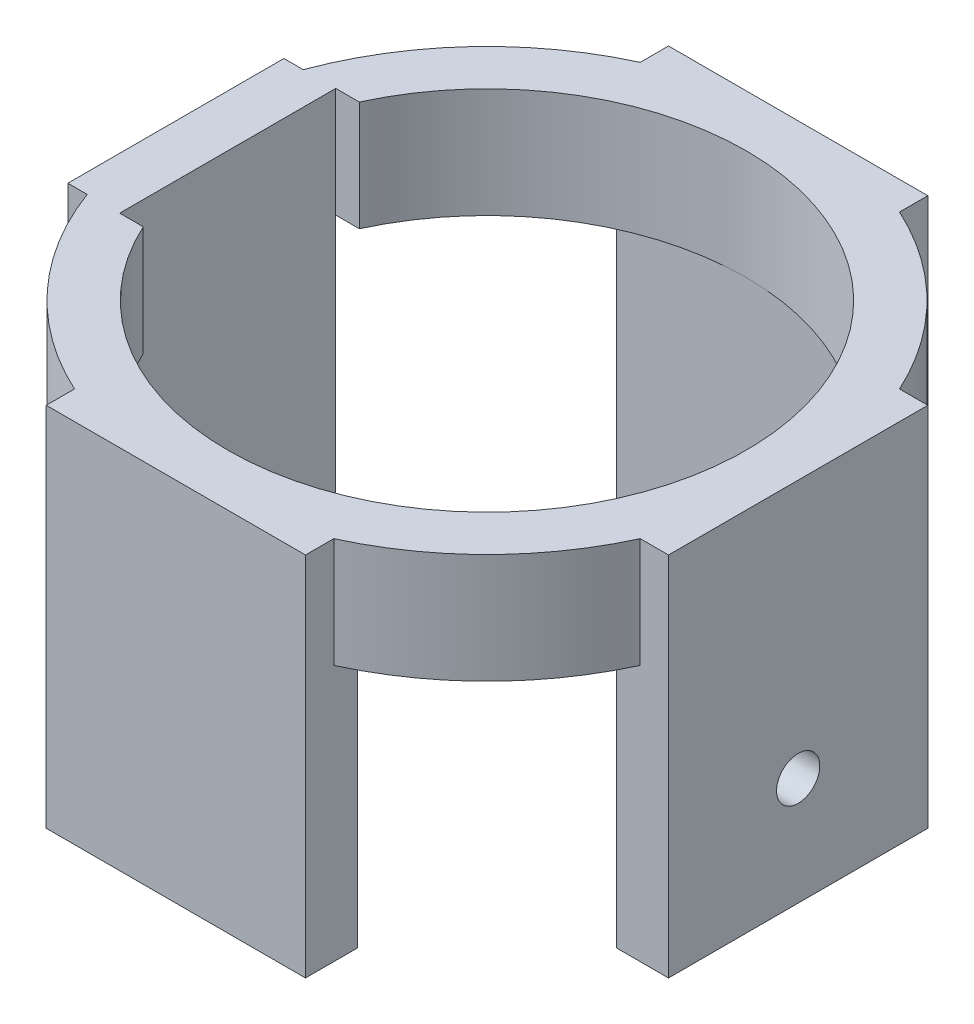
ISO-10303-21;
HEADER;
FILE_DESCRIPTION(('STEP AP214'),'2;1');
FILE_NAME('part.step','',(''),(''),'','','');
FILE_SCHEMA(('AUTOMOTIVE_DESIGN { 1 0 10303 214 1 1 1 1 }'));
ENDSEC;
DATA;
#1=APPLICATION_CONTEXT('core data for automotive mechanical design processes');
#2=APPLICATION_PROTOCOL_DEFINITION('international standard','automotive_design',2000,#1);
#3=PRODUCT_CONTEXT('',#1,'mechanical');
#4=PRODUCT('Part','Part','',(#3));
#5=PRODUCT_RELATED_PRODUCT_CATEGORY('part','',(#4));
#6=PRODUCT_DEFINITION_FORMATION('','',#4);
#7=PRODUCT_DEFINITION_CONTEXT('part definition',#1,'design');
#8=PRODUCT_DEFINITION('design','',#6,#7);
#9=PRODUCT_DEFINITION_SHAPE('','',#8);
#10=(LENGTH_UNIT() NAMED_UNIT(*) SI_UNIT(.MILLI.,.METRE.));
#11=(NAMED_UNIT(*) PLANE_ANGLE_UNIT() SI_UNIT($,.RADIAN.));
#12=(NAMED_UNIT(*) SI_UNIT($,.STERADIAN.) SOLID_ANGLE_UNIT());
#13=UNCERTAINTY_MEASURE_WITH_UNIT(LENGTH_MEASURE(1.E-05),#10,'distance_accuracy_value','');
#14=(GEOMETRIC_REPRESENTATION_CONTEXT(3) GLOBAL_UNCERTAINTY_ASSIGNED_CONTEXT((#13)) GLOBAL_UNIT_ASSIGNED_CONTEXT((#10,
#11,#12)) REPRESENTATION_CONTEXT('',''));
#15=CARTESIAN_POINT('',(0.,0.,0.));
#16=DIRECTION('',(0.,0.,1.));
#17=DIRECTION('',(1.,0.,0.));
#18=AXIS2_PLACEMENT_3D('',#15,#16,#17);
#19=CARTESIAN_POINT('',(60.,0.,0.));
#20=DIRECTION('',(1.,0.,0.));
#21=DIRECTION('',(0.,0.,-1.));
#22=AXIS2_PLACEMENT_3D('',#19,#20,#21);
#23=PLANE('',#22);
#24=DIRECTION('',(0.,-1.,0.));
#25=VECTOR('',#24,1.);
#26=CARTESIAN_POINT('',(60.,0.,30.));
#27=LINE('',#26,#25);
#28=CARTESIAN_POINT('',(60.,-25.4,30.));
#29=VERTEX_POINT('',#28);
#30=CARTESIAN_POINT('',(60.,-84.7705,30.));
#31=VERTEX_POINT('',#30);
#32=EDGE_CURVE('E266',#29,#31,#27,.T.);
#33=ORIENTED_EDGE('',*,*,#32,.F.);
#34=DIRECTION('',(0.,0.,-1.));
#35=VECTOR('',#34,1.);
#36=CARTESIAN_POINT('',(60.,-25.4,0.));
#37=LINE('',#36,#35);
#38=CARTESIAN_POINT('',(60.,-25.4,0.));
#39=VERTEX_POINT('',#38);
#40=EDGE_CURVE('E285',#29,#39,#37,.T.);
#41=ORIENTED_EDGE('',*,*,#40,.T.);
#42=CARTESIAN_POINT('',(60.,-25.4,-30.));
#43=VERTEX_POINT('',#42);
#44=EDGE_CURVE('E281',#39,#43,#37,.T.);
#45=ORIENTED_EDGE('',*,*,#44,.T.);
#46=DIRECTION('',(0.,-1.,0.));
#47=VECTOR('',#46,1.);
#48=CARTESIAN_POINT('',(60.,0.,-30.));
#49=LINE('',#48,#47);
#50=CARTESIAN_POINT('',(60.,-84.7705,-30.));
#51=VERTEX_POINT('',#50);
#52=EDGE_CURVE('E262',#43,#51,#49,.T.);
#53=ORIENTED_EDGE('',*,*,#52,.T.);
#54=DIRECTION('',(0.,0.,1.));
#55=VECTOR('',#54,1.);
#56=CARTESIAN_POINT('',(60.,-84.7705,-30.));
#57=LINE('',#56,#55);
#58=EDGE_CURVE('E248',#51,#31,#57,.T.);
#59=ORIENTED_EDGE('',*,*,#58,.T.);
#60=EDGE_LOOP('',(#33,#41,#45,#53,#59));
#61=FACE_BOUND('',#60,.T.);
#62=CARTESIAN_POINT('',(60.,-59.7705,0.));
#63=DIRECTION('',(-1.,0.,0.));
#64=DIRECTION('',(0.,0.,1.));
#65=AXIS2_PLACEMENT_3D('',#62,#63,#64);
#66=CIRCLE('',#65,5.);
#67=CARTESIAN_POINT('',(60.,-59.7705,4.99999999999999));
#68=VERTEX_POINT('',#67);
#69=EDGE_CURVE('E568',#68,#68,#66,.T.);
#70=ORIENTED_EDGE('',*,*,#69,.F.);
#71=EDGE_LOOP('',(#70));
#72=FACE_BOUND('',#71,.T.);
#73=ADVANCED_FACE('F39',(#61,#72),#23,.F.);
#74=CARTESIAN_POINT('',(0.,-25.4,0.));
#75=DIRECTION('',(0.,1.,0.));
#76=DIRECTION('',(0.,0.,1.));
#77=AXIS2_PLACEMENT_3D('',#74,#75,#76);
#78=PLANE('',#77);
#79=CARTESIAN_POINT('',(0.,-25.4,0.));
#80=DIRECTION('',(0.,1.,0.));
#81=DIRECTION('',(0.,0.,1.));
#82=AXIS2_PLACEMENT_3D('',#79,#80,#81);
#83=CIRCLE('',#82,72.);
#84=CARTESIAN_POINT('',(29.9999999999998,-25.4,65.4522726878144));
#85=VERTEX_POINT('',#84);
#86=CARTESIAN_POINT('',(65.4522726878143,-25.4,30.));
#87=VERTEX_POINT('',#86);
#88=EDGE_CURVE('E63',#85,#87,#83,.T.);
#89=ORIENTED_EDGE('',*,*,#88,.F.);
#90=DIRECTION('',(0.,0.,-1.));
#91=VECTOR('',#90,1.);
#92=CARTESIAN_POINT('',(30.,-25.4,1.04744440165294E-13));
#93=LINE('',#92,#91);
#94=CARTESIAN_POINT('',(29.9999999999998,-25.4,60.0000000000001));
#95=VERTEX_POINT('',#94);
#96=EDGE_CURVE('E517',#85,#95,#93,.T.);
#97=ORIENTED_EDGE('',*,*,#96,.T.);
#98=DIRECTION('',(1.,0.,0.));
#99=VECTOR('',#98,1.);
#100=CARTESIAN_POINT('',(-2.09488880330588E-13,-25.4,60.));
#101=LINE('',#100,#99);
#102=CARTESIAN_POINT('',(-2.09488880330588E-13,-25.4,60.));
#103=VERTEX_POINT('',#102);
#104=EDGE_CURVE('E493',#103,#95,#101,.T.);
#105=ORIENTED_EDGE('',*,*,#104,.F.);
#106=CARTESIAN_POINT('',(0.,-25.4,0.));
#107=DIRECTION('',(0.,1.,0.));
#108=DIRECTION('',(0.,0.,1.));
#109=AXIS2_PLACEMENT_3D('',#106,#107,#108);
#110=CIRCLE('',#109,60.);
#111=EDGE_CURVE('E393',#103,#39,#110,.T.);
#112=ORIENTED_EDGE('',*,*,#111,.T.);
#113=ORIENTED_EDGE('',*,*,#40,.F.);
#114=DIRECTION('',(-1.,0.,0.));
#115=VECTOR('',#114,1.);
#116=CARTESIAN_POINT('',(0.,-25.4,30.));
#117=LINE('',#116,#115);
#118=EDGE_CURVE('E286',#87,#29,#117,.T.);
#119=ORIENTED_EDGE('',*,*,#118,.F.);
#120=EDGE_LOOP('',(#89,#97,#105,#112,#113,#119));
#121=FACE_BOUND('',#120,.T.);
#122=ADVANCED_FACE('F576',(#121),#78,.F.);
#123=CARTESIAN_POINT('',(0.,-25.4,0.));
#124=DIRECTION('',(0.,1.,0.));
#125=DIRECTION('',(0.,0.,1.));
#126=AXIS2_PLACEMENT_3D('',#123,#124,#125);
#127=CYLINDRICAL_SURFACE('',#126,72.);
#128=ORIENTED_EDGE('',*,*,#88,.T.);
#129=DIRECTION('',(0.,1.,0.));
#130=VECTOR('',#129,1.);
#131=CARTESIAN_POINT('',(65.4522726878143,-25.4,30.));
#132=LINE('',#131,#130);
#133=CARTESIAN_POINT('',(65.4522726878143,0.,30.));
#134=VERTEX_POINT('',#133);
#135=EDGE_CURVE('E290',#87,#134,#132,.T.);
#136=ORIENTED_EDGE('',*,*,#135,.T.);
#137=CARTESIAN_POINT('',(0.,0.,0.));
#138=DIRECTION('',(0.,1.,0.));
#139=DIRECTION('',(0.,0.,1.));
#140=AXIS2_PLACEMENT_3D('',#137,#138,#139);
#141=CIRCLE('',#140,72.);
#142=CARTESIAN_POINT('',(29.9999999999998,0.,65.4522726878144));
#143=VERTEX_POINT('',#142);
#144=EDGE_CURVE('E55',#143,#134,#141,.T.);
#145=ORIENTED_EDGE('',*,*,#144,.F.);
#146=DIRECTION('',(0.,1.,0.));
#147=VECTOR('',#146,1.);
#148=CARTESIAN_POINT('',(29.9999999999998,-25.4,65.4522726878144));
#149=LINE('',#148,#147);
#150=EDGE_CURVE('E48',#85,#143,#149,.T.);
#151=ORIENTED_EDGE('',*,*,#150,.F.);
#152=EDGE_LOOP('',(#128,#136,#145,#151));
#153=FACE_BOUND('',#152,.T.);
#154=ADVANCED_FACE('F581',(#153),#127,.T.);
#155=CARTESIAN_POINT('',(29.9999999999994,0.,175.85585043824));
#156=DIRECTION('',(1.,0.,0.));
#157=DIRECTION('',(0.,1.,0.));
#158=AXIS2_PLACEMENT_3D('',#155,#156,#157);
#159=PLANE('',#158);
#160=ORIENTED_EDGE('',*,*,#96,.F.);
#161=ORIENTED_EDGE('',*,*,#150,.T.);
#162=DIRECTION('',(0.,0.,-1.));
#163=VECTOR('',#162,1.);
#164=CARTESIAN_POINT('',(29.9999999999994,0.,175.85585043824));
#165=LINE('',#164,#163);
#166=CARTESIAN_POINT('',(29.9999999999998,0.,72.0000000000001));
#167=VERTEX_POINT('',#166);
#168=EDGE_CURVE('E11',#167,#143,#165,.T.);
#169=ORIENTED_EDGE('',*,*,#168,.F.);
#170=DIRECTION('',(0.,-1.,0.));
#171=VECTOR('',#170,1.);
#172=CARTESIAN_POINT('',(29.9999999999998,0.,72.0000000000001));
#173=LINE('',#172,#171);
#174=CARTESIAN_POINT('',(29.9999999999997,-84.7705,72.0000000000001));
#175=VERTEX_POINT('',#174);
#176=EDGE_CURVE('E509',#167,#175,#173,.T.);
#177=ORIENTED_EDGE('',*,*,#176,.T.);
#178=DIRECTION('',(0.,0.,-1.));
#179=VECTOR('',#178,1.);
#180=CARTESIAN_POINT('',(29.9999999999994,-84.7705,175.85585043824));
#181=LINE('',#180,#179);
#182=CARTESIAN_POINT('',(29.9999999999998,-84.7705,60.0000000000001));
#183=VERTEX_POINT('',#182);
#184=EDGE_CURVE('E501',#175,#183,#181,.T.);
#185=ORIENTED_EDGE('',*,*,#184,.T.);
#186=DIRECTION('',(0.,-1.,0.));
#187=VECTOR('',#186,1.);
#188=CARTESIAN_POINT('',(29.9999999999998,0.,60.0000000000001));
#189=LINE('',#188,#187);
#190=EDGE_CURVE('E494',#95,#183,#189,.T.);
#191=ORIENTED_EDGE('',*,*,#190,.F.);
#192=EDGE_LOOP('',(#160,#161,#169,#177,#185,#191));
#193=FACE_BOUND('',#192,.T.);
#194=ADVANCED_FACE('F41',(#193),#159,.T.);
#195=CARTESIAN_POINT('',(-2.51386656396706E-13,0.,72.));
#196=DIRECTION('',(0.,0.,1.));
#197=DIRECTION('',(1.,0.,0.));
#198=AXIS2_PLACEMENT_3D('',#195,#196,#197);
#199=PLANE('',#198);
#200=ORIENTED_EDGE('',*,*,#176,.F.);
#201=DIRECTION('',(-1.,0.,0.));
#202=VECTOR('',#201,1.);
#203=CARTESIAN_POINT('',(29.9999999999998,0.,72.0000000000001));
#204=LINE('',#203,#202);
#205=CARTESIAN_POINT('',(-30.0000000000003,0.,71.9999999999999));
#206=VERTEX_POINT('',#205);
#207=EDGE_CURVE('E513',#167,#206,#204,.T.);
#208=ORIENTED_EDGE('',*,*,#207,.T.);
#209=DIRECTION('',(0.,-1.,0.));
#210=VECTOR('',#209,1.);
#211=CARTESIAN_POINT('',(-30.0000000000003,0.,71.9999999999999));
#212=LINE('',#211,#210);
#213=CARTESIAN_POINT('',(-30.0000000000003,-84.7705,71.9999999999999));
#214=VERTEX_POINT('',#213);
#215=EDGE_CURVE('E481',#206,#214,#212,.T.);
#216=ORIENTED_EDGE('',*,*,#215,.T.);
#217=DIRECTION('',(-1.,0.,0.));
#218=VECTOR('',#217,1.);
#219=CARTESIAN_POINT('',(29.9999999999997,-84.7705,72.0000000000001));
#220=LINE('',#219,#218);
#221=EDGE_CURVE('E505',#175,#214,#220,.T.);
#222=ORIENTED_EDGE('',*,*,#221,.F.);
#223=EDGE_LOOP('',(#200,#208,#216,#222));
#224=FACE_BOUND('',#223,.T.);
#225=ADVANCED_FACE('F529',(#224),#199,.T.);
#226=CARTESIAN_POINT('',(29.9999999999994,-84.7705,175.85585043824));
#227=DIRECTION('',(0.,-1.,0.));
#228=DIRECTION('',(1.,0.,0.));
#229=AXIS2_PLACEMENT_3D('',#226,#227,#228);
#230=PLANE('',#229);
#231=ORIENTED_EDGE('',*,*,#184,.F.);
#232=ORIENTED_EDGE('',*,*,#221,.T.);
#233=DIRECTION('',(0.,0.,-1.));
#234=VECTOR('',#233,1.);
#235=CARTESIAN_POINT('',(-30.0000000000006,-84.7705,175.85585043824));
#236=LINE('',#235,#234);
#237=CARTESIAN_POINT('',(-30.0000000000002,-84.7705,59.9999999999999));
#238=VERTEX_POINT('',#237);
#239=EDGE_CURVE('E477',#214,#238,#236,.T.);
#240=ORIENTED_EDGE('',*,*,#239,.T.);
#241=DIRECTION('',(-1.,0.,0.));
#242=VECTOR('',#241,1.);
#243=CARTESIAN_POINT('',(29.9999999999998,-84.7705,60.0000000000001));
#244=LINE('',#243,#242);
#245=EDGE_CURVE('E497',#183,#238,#244,.T.);
#246=ORIENTED_EDGE('',*,*,#245,.F.);
#247=EDGE_LOOP('',(#231,#232,#240,#246));
#248=FACE_BOUND('',#247,.T.);
#249=ADVANCED_FACE('F533',(#248),#230,.T.);
#250=CARTESIAN_POINT('',(-2.09488880330588E-13,0.,60.));
#251=DIRECTION('',(0.,0.,1.));
#252=DIRECTION('',(1.,0.,0.));
#253=AXIS2_PLACEMENT_3D('',#250,#251,#252);
#254=PLANE('',#253);
#255=DIRECTION('',(0.,-1.,0.));
#256=VECTOR('',#255,1.);
#257=CARTESIAN_POINT('',(-30.0000000000002,0.,59.9999999999999));
#258=LINE('',#257,#256);
#259=CARTESIAN_POINT('',(-30.0000000000002,-25.4,59.9999999999999));
#260=VERTEX_POINT('',#259);
#261=EDGE_CURVE('E474',#260,#238,#258,.T.);
#262=ORIENTED_EDGE('',*,*,#261,.F.);
#263=EDGE_CURVE('E489',#260,#103,#101,.T.);
#264=ORIENTED_EDGE('',*,*,#263,.T.);
#265=ORIENTED_EDGE('',*,*,#104,.T.);
#266=ORIENTED_EDGE('',*,*,#190,.T.);
#267=ORIENTED_EDGE('',*,*,#245,.T.);
#268=EDGE_LOOP('',(#262,#264,#265,#266,#267));
#269=FACE_BOUND('',#268,.T.);
#270=ADVANCED_FACE('F536',(#269),#254,.F.);
#271=CARTESIAN_POINT('',(-30.0000000000006,0.,175.85585043824));
#272=DIRECTION('',(1.,0.,0.));
#273=DIRECTION('',(0.,1.,0.));
#274=AXIS2_PLACEMENT_3D('',#271,#272,#273);
#275=PLANE('',#274);
#276=DIRECTION('',(0.,1.,0.));
#277=VECTOR('',#276,1.);
#278=CARTESIAN_POINT('',(-30.0000000000002,-25.4,65.4522726878142));
#279=LINE('',#278,#277);
#280=CARTESIAN_POINT('',(-30.0000000000002,-25.4,65.4522726878142));
#281=VERTEX_POINT('',#280);
#282=CARTESIAN_POINT('',(-30.0000000000002,0.,65.4522726878142));
#283=VERTEX_POINT('',#282);
#284=EDGE_CURVE('E467',#281,#283,#279,.T.);
#285=ORIENTED_EDGE('',*,*,#284,.F.);
#286=DIRECTION('',(0.,0.,-1.));
#287=VECTOR('',#286,1.);
#288=CARTESIAN_POINT('',(-30.,-25.4,-1.04744440165294E-13));
#289=LINE('',#288,#287);
#290=EDGE_CURVE('E471',#281,#260,#289,.T.);
#291=ORIENTED_EDGE('',*,*,#290,.T.);
#292=ORIENTED_EDGE('',*,*,#261,.T.);
#293=ORIENTED_EDGE('',*,*,#239,.F.);
#294=ORIENTED_EDGE('',*,*,#215,.F.);
#295=DIRECTION('',(0.,0.,-1.));
#296=VECTOR('',#295,1.);
#297=CARTESIAN_POINT('',(-30.0000000000006,0.,175.85585043824));
#298=LINE('',#297,#296);
#299=EDGE_CURVE('E485',#206,#283,#298,.T.);
#300=ORIENTED_EDGE('',*,*,#299,.T.);
#301=EDGE_LOOP('',(#285,#291,#292,#293,#294,#300));
#302=FACE_BOUND('',#301,.T.);
#303=ADVANCED_FACE('F660',(#302),#275,.F.);
#304=CARTESIAN_POINT('',(-30.0000000000002,-25.4,-65.4522726878142));
#305=VERTEX_POINT('',#304);
#306=CARTESIAN_POINT('',(-67.5203672975792,-25.4,-25.));
#307=VERTEX_POINT('',#306);
#308=EDGE_CURVE('E399',#305,#307,#83,.T.);
#309=ORIENTED_EDGE('',*,*,#308,.F.);
#310=DIRECTION('',(0.,0.,1.));
#311=VECTOR('',#310,1.);
#312=CARTESIAN_POINT('',(-30.,-25.4,1.04744440165294E-13));
#313=LINE('',#312,#311);
#314=CARTESIAN_POINT('',(-30.0000000000002,-25.4,-59.9999999999999));
#315=VERTEX_POINT('',#314);
#316=EDGE_CURVE('E455',#305,#315,#313,.T.);
#317=ORIENTED_EDGE('',*,*,#316,.T.);
#318=DIRECTION('',(-1.,0.,0.));
#319=VECTOR('',#318,1.);
#320=CARTESIAN_POINT('',(-2.09488880330588E-13,-25.4,-60.));
#321=LINE('',#320,#319);
#322=CARTESIAN_POINT('',(-2.09488880330588E-13,-25.4,-60.));
#323=VERTEX_POINT('',#322);
#324=EDGE_CURVE('E431',#323,#315,#321,.T.);
#325=ORIENTED_EDGE('',*,*,#324,.F.);
#326=CARTESIAN_POINT('',(-54.5435605731786,-25.4,-25.));
#327=VERTEX_POINT('',#326);
#328=EDGE_CURVE('E409',#323,#327,#110,.T.);
#329=ORIENTED_EDGE('',*,*,#328,.T.);
#330=DIRECTION('',(1.,0.,0.));
#331=VECTOR('',#330,1.);
#332=CARTESIAN_POINT('',(-60.,-25.4,-25.));
#333=LINE('',#332,#331);
#334=CARTESIAN_POINT('',(-60.,-25.4,-25.));
#335=VERTEX_POINT('',#334);
#336=EDGE_CURVE('E300',#335,#327,#333,.T.);
#337=ORIENTED_EDGE('',*,*,#336,.F.);
#338=DIRECTION('',(1.,0.,0.));
#339=VECTOR('',#338,1.);
#340=CARTESIAN_POINT('',(0.,-25.4,-25.));
#341=LINE('',#340,#339);
#342=EDGE_CURVE('E378',#307,#335,#341,.T.);
#343=ORIENTED_EDGE('',*,*,#342,.F.);
#344=EDGE_LOOP('',(#309,#317,#325,#329,#337,#343));
#345=FACE_BOUND('',#344,.T.);
#346=ADVANCED_FACE('F583',(#345),#78,.F.);
#347=ORIENTED_EDGE('',*,*,#308,.T.);
#348=DIRECTION('',(0.,1.,0.));
#349=VECTOR('',#348,1.);
#350=CARTESIAN_POINT('',(-67.5203672975792,-25.4,-25.));
#351=LINE('',#350,#349);
#352=CARTESIAN_POINT('',(-67.5203672975792,0.,-25.));
#353=VERTEX_POINT('',#352);
#354=EDGE_CURVE('E382',#307,#353,#351,.T.);
#355=ORIENTED_EDGE('',*,*,#354,.T.);
#356=CARTESIAN_POINT('',(-30.0000000000002,0.,-65.4522726878142));
#357=VERTEX_POINT('',#356);
#358=EDGE_CURVE('E543',#357,#353,#141,.T.);
#359=ORIENTED_EDGE('',*,*,#358,.F.);
#360=DIRECTION('',(0.,1.,0.));
#361=VECTOR('',#360,1.);
#362=CARTESIAN_POINT('',(-30.0000000000002,-25.4,-65.4522726878142));
#363=LINE('',#362,#361);
#364=EDGE_CURVE('E459',#305,#357,#363,.T.);
#365=ORIENTED_EDGE('',*,*,#364,.F.);
#366=EDGE_LOOP('',(#347,#355,#359,#365));
#367=FACE_BOUND('',#366,.T.);
#368=ADVANCED_FACE('F658',(#367),#127,.T.);
#369=CARTESIAN_POINT('',(-30.0000000000006,0.,-175.85585043824));
#370=DIRECTION('',(-1.,0.,0.));
#371=DIRECTION('',(0.,1.,0.));
#372=AXIS2_PLACEMENT_3D('',#369,#370,#371);
#373=PLANE('',#372);
#374=ORIENTED_EDGE('',*,*,#316,.F.);
#375=ORIENTED_EDGE('',*,*,#364,.T.);
#376=DIRECTION('',(0.,0.,1.));
#377=VECTOR('',#376,1.);
#378=CARTESIAN_POINT('',(-30.0000000000006,0.,-175.85585043824));
#379=LINE('',#378,#377);
#380=CARTESIAN_POINT('',(-30.0000000000003,0.,-71.9999999999999));
#381=VERTEX_POINT('',#380);
#382=EDGE_CURVE('E463',#381,#357,#379,.T.);
#383=ORIENTED_EDGE('',*,*,#382,.F.);
#384=DIRECTION('',(0.,-1.,0.));
#385=VECTOR('',#384,1.);
#386=CARTESIAN_POINT('',(-30.0000000000003,0.,-71.9999999999999));
#387=LINE('',#386,#385);
#388=CARTESIAN_POINT('',(-30.0000000000002,-84.7705,-71.9999999999999));
#389=VERTEX_POINT('',#388);
#390=EDGE_CURVE('E447',#381,#389,#387,.T.);
#391=ORIENTED_EDGE('',*,*,#390,.T.);
#392=DIRECTION('',(0.,0.,1.));
#393=VECTOR('',#392,1.);
#394=CARTESIAN_POINT('',(-30.0000000000006,-84.7705,-175.85585043824));
#395=LINE('',#394,#393);
#396=CARTESIAN_POINT('',(-30.0000000000002,-84.7705,-59.9999999999999));
#397=VERTEX_POINT('',#396);
#398=EDGE_CURVE('E439',#389,#397,#395,.T.);
#399=ORIENTED_EDGE('',*,*,#398,.T.);
#400=DIRECTION('',(0.,-1.,0.));
#401=VECTOR('',#400,1.);
#402=CARTESIAN_POINT('',(-30.0000000000002,0.,-59.9999999999999));
#403=LINE('',#402,#401);
#404=EDGE_CURVE('E432',#315,#397,#403,.T.);
#405=ORIENTED_EDGE('',*,*,#404,.F.);
#406=EDGE_LOOP('',(#374,#375,#383,#391,#399,#405));
#407=FACE_BOUND('',#406,.T.);
#408=ADVANCED_FACE('F654',(#407),#373,.T.);
#409=CARTESIAN_POINT('',(-2.51386656396706E-13,0.,-72.));
#410=DIRECTION('',(0.,0.,-1.));
#411=DIRECTION('',(-1.,0.,0.));
#412=AXIS2_PLACEMENT_3D('',#409,#410,#411);
#413=PLANE('',#412);
#414=ORIENTED_EDGE('',*,*,#390,.F.);
#415=DIRECTION('',(1.,0.,0.));
#416=VECTOR('',#415,1.);
#417=CARTESIAN_POINT('',(-30.0000000000003,0.,-71.9999999999999));
#418=LINE('',#417,#416);
#419=CARTESIAN_POINT('',(29.9999999999998,0.,-72.0000000000001));
#420=VERTEX_POINT('',#419);
#421=EDGE_CURVE('E451',#381,#420,#418,.T.);
#422=ORIENTED_EDGE('',*,*,#421,.T.);
#423=DIRECTION('',(0.,-1.,0.));
#424=VECTOR('',#423,1.);
#425=CARTESIAN_POINT('',(29.9999999999998,0.,-72.0000000000001));
#426=LINE('',#425,#424);
#427=CARTESIAN_POINT('',(29.9999999999998,-84.7705,-72.0000000000001));
#428=VERTEX_POINT('',#427);
#429=EDGE_CURVE('E419',#420,#428,#426,.T.);
#430=ORIENTED_EDGE('',*,*,#429,.T.);
#431=DIRECTION('',(1.,0.,0.));
#432=VECTOR('',#431,1.);
#433=CARTESIAN_POINT('',(-30.0000000000002,-84.7705,-71.9999999999999));
#434=LINE('',#433,#432);
#435=EDGE_CURVE('E443',#389,#428,#434,.T.);
#436=ORIENTED_EDGE('',*,*,#435,.F.);
#437=EDGE_LOOP('',(#414,#422,#430,#436));
#438=FACE_BOUND('',#437,.T.);
#439=ADVANCED_FACE('F650',(#438),#413,.T.);
#440=CARTESIAN_POINT('',(-30.0000000000006,-84.7705,-175.85585043824));
#441=DIRECTION('',(0.,-1.,0.));
#442=DIRECTION('',(-1.,0.,0.));
#443=AXIS2_PLACEMENT_3D('',#440,#441,#442);
#444=PLANE('',#443);
#445=ORIENTED_EDGE('',*,*,#398,.F.);
#446=ORIENTED_EDGE('',*,*,#435,.T.);
#447=DIRECTION('',(0.,0.,1.));
#448=VECTOR('',#447,1.);
#449=CARTESIAN_POINT('',(29.9999999999994,-84.7705,-175.85585043824));
#450=LINE('',#449,#448);
#451=CARTESIAN_POINT('',(29.9999999999998,-84.7705,-60.0000000000001));
#452=VERTEX_POINT('',#451);
#453=EDGE_CURVE('E415',#428,#452,#450,.T.);
#454=ORIENTED_EDGE('',*,*,#453,.T.);
#455=DIRECTION('',(1.,0.,0.));
#456=VECTOR('',#455,1.);
#457=CARTESIAN_POINT('',(-30.0000000000002,-84.7705,-59.9999999999999));
#458=LINE('',#457,#456);
#459=EDGE_CURVE('E435',#397,#452,#458,.T.);
#460=ORIENTED_EDGE('',*,*,#459,.F.);
#461=EDGE_LOOP('',(#445,#446,#454,#460));
#462=FACE_BOUND('',#461,.T.);
#463=ADVANCED_FACE('F646',(#462),#444,.T.);
#464=CARTESIAN_POINT('',(-2.09488880330588E-13,0.,-60.));
#465=DIRECTION('',(0.,0.,-1.));
#466=DIRECTION('',(-1.,0.,0.));
#467=AXIS2_PLACEMENT_3D('',#464,#465,#466);
#468=PLANE('',#467);
#469=DIRECTION('',(0.,-1.,0.));
#470=VECTOR('',#469,1.);
#471=CARTESIAN_POINT('',(29.9999999999998,0.,-60.0000000000001));
#472=LINE('',#471,#470);
#473=CARTESIAN_POINT('',(29.9999999999998,-25.4,-60.0000000000001));
#474=VERTEX_POINT('',#473);
#475=EDGE_CURVE('E412',#474,#452,#472,.T.);
#476=ORIENTED_EDGE('',*,*,#475,.F.);
#477=EDGE_CURVE('E427',#474,#323,#321,.T.);
#478=ORIENTED_EDGE('',*,*,#477,.T.);
#479=ORIENTED_EDGE('',*,*,#324,.T.);
#480=ORIENTED_EDGE('',*,*,#404,.T.);
#481=ORIENTED_EDGE('',*,*,#459,.T.);
#482=EDGE_LOOP('',(#476,#478,#479,#480,#481));
#483=FACE_BOUND('',#482,.T.);
#484=ADVANCED_FACE('F642',(#483),#468,.F.);
#485=CARTESIAN_POINT('',(29.9999999999994,0.,-175.85585043824));
#486=DIRECTION('',(-1.,0.,0.));
#487=DIRECTION('',(0.,1.,0.));
#488=AXIS2_PLACEMENT_3D('',#485,#486,#487);
#489=PLANE('',#488);
#490=DIRECTION('',(0.,1.,0.));
#491=VECTOR('',#490,1.);
#492=CARTESIAN_POINT('',(29.9999999999998,-25.4,-65.4522726878144));
#493=LINE('',#492,#491);
#494=CARTESIAN_POINT('',(29.9999999999998,-25.4,-65.4522726878144));
#495=VERTEX_POINT('',#494);
#496=CARTESIAN_POINT('',(29.9999999999998,0.,-65.4522726878144));
#497=VERTEX_POINT('',#496);
#498=EDGE_CURVE('E404',#495,#497,#493,.T.);
#499=ORIENTED_EDGE('',*,*,#498,.F.);
#500=DIRECTION('',(0.,0.,1.));
#501=VECTOR('',#500,1.);
#502=CARTESIAN_POINT('',(30.,-25.4,-1.04744440165294E-13));
#503=LINE('',#502,#501);
#504=EDGE_CURVE('E408',#495,#474,#503,.T.);
#505=ORIENTED_EDGE('',*,*,#504,.T.);
#506=ORIENTED_EDGE('',*,*,#475,.T.);
#507=ORIENTED_EDGE('',*,*,#453,.F.);
#508=ORIENTED_EDGE('',*,*,#429,.F.);
#509=DIRECTION('',(0.,0.,1.));
#510=VECTOR('',#509,1.);
#511=CARTESIAN_POINT('',(29.9999999999994,0.,-175.85585043824));
#512=LINE('',#511,#510);
#513=EDGE_CURVE('E423',#420,#497,#512,.T.);
#514=ORIENTED_EDGE('',*,*,#513,.T.);
#515=EDGE_LOOP('',(#499,#505,#506,#507,#508,#514));
#516=FACE_BOUND('',#515,.T.);
#517=ADVANCED_FACE('F639',(#516),#489,.F.);
#518=CARTESIAN_POINT('',(-67.5203672975792,-25.4,25.));
#519=VERTEX_POINT('',#518);
#520=EDGE_CURVE('E396',#519,#281,#83,.T.);
#521=ORIENTED_EDGE('',*,*,#520,.T.);
#522=ORIENTED_EDGE('',*,*,#284,.T.);
#523=CARTESIAN_POINT('',(-67.5203672975792,0.,25.));
#524=VERTEX_POINT('',#523);
#525=EDGE_CURVE('E401',#524,#283,#141,.T.);
#526=ORIENTED_EDGE('',*,*,#525,.F.);
#527=DIRECTION('',(0.,1.,0.));
#528=VECTOR('',#527,1.);
#529=CARTESIAN_POINT('',(-67.5203672975792,-25.4,25.));
#530=LINE('',#529,#528);
#531=EDGE_CURVE('E374',#519,#524,#530,.T.);
#532=ORIENTED_EDGE('',*,*,#531,.F.);
#533=EDGE_LOOP('',(#521,#522,#526,#532));
#534=FACE_BOUND('',#533,.T.);
#535=ADVANCED_FACE('F638',(#534),#127,.T.);
#536=ORIENTED_EDGE('',*,*,#520,.F.);
#537=DIRECTION('',(1.,0.,0.));
#538=VECTOR('',#537,1.);
#539=CARTESIAN_POINT('',(0.,-25.4,25.));
#540=LINE('',#539,#538);
#541=CARTESIAN_POINT('',(-60.,-25.4,25.));
#542=VERTEX_POINT('',#541);
#543=EDGE_CURVE('E356',#519,#542,#540,.T.);
#544=ORIENTED_EDGE('',*,*,#543,.T.);
#545=DIRECTION('',(-1.,0.,0.));
#546=VECTOR('',#545,1.);
#547=CARTESIAN_POINT('',(-60.,-25.4,25.));
#548=LINE('',#547,#546);
#549=CARTESIAN_POINT('',(-54.5435605731786,-25.4,25.));
#550=VERTEX_POINT('',#549);
#551=EDGE_CURVE('E299',#550,#542,#548,.T.);
#552=ORIENTED_EDGE('',*,*,#551,.F.);
#553=EDGE_CURVE('E387',#550,#103,#110,.T.);
#554=ORIENTED_EDGE('',*,*,#553,.T.);
#555=ORIENTED_EDGE('',*,*,#263,.F.);
#556=ORIENTED_EDGE('',*,*,#290,.F.);
#557=EDGE_LOOP('',(#536,#544,#552,#554,#555,#556));
#558=FACE_BOUND('',#557,.T.);
#559=ADVANCED_FACE('F631',(#558),#78,.F.);
#560=CARTESIAN_POINT('',(65.4522726878143,-25.4,-30.));
#561=VERTEX_POINT('',#560);
#562=EDGE_CURVE('E400',#561,#495,#83,.T.);
#563=ORIENTED_EDGE('',*,*,#562,.T.);
#564=ORIENTED_EDGE('',*,*,#498,.T.);
#565=CARTESIAN_POINT('',(65.4522726878143,0.,-30.));
#566=VERTEX_POINT('',#565);
#567=EDGE_CURVE('E391',#566,#497,#141,.T.);
#568=ORIENTED_EDGE('',*,*,#567,.F.);
#569=DIRECTION('',(0.,1.,0.));
#570=VECTOR('',#569,1.);
#571=CARTESIAN_POINT('',(65.4522726878143,-25.4,-30.));
#572=LINE('',#571,#570);
#573=EDGE_CURVE('E296',#561,#566,#572,.T.);
#574=ORIENTED_EDGE('',*,*,#573,.F.);
#575=EDGE_LOOP('',(#563,#564,#568,#574));
#576=FACE_BOUND('',#575,.T.);
#577=ADVANCED_FACE('F629',(#576),#127,.T.);
#578=ORIENTED_EDGE('',*,*,#562,.F.);
#579=DIRECTION('',(-1.,0.,0.));
#580=VECTOR('',#579,1.);
#581=CARTESIAN_POINT('',(0.,-25.4,-30.));
#582=LINE('',#581,#580);
#583=EDGE_CURVE('E293',#561,#43,#582,.T.);
#584=ORIENTED_EDGE('',*,*,#583,.T.);
#585=ORIENTED_EDGE('',*,*,#44,.F.);
#586=EDGE_CURVE('E392',#39,#323,#110,.T.);
#587=ORIENTED_EDGE('',*,*,#586,.T.);
#588=ORIENTED_EDGE('',*,*,#477,.F.);
#589=ORIENTED_EDGE('',*,*,#504,.F.);
#590=EDGE_LOOP('',(#578,#584,#585,#587,#588,#589));
#591=FACE_BOUND('',#590,.T.);
#592=ADVANCED_FACE('F584',(#591),#78,.F.);
#593=CARTESIAN_POINT('',(0.,0.,0.));
#594=DIRECTION('',(0.,1.,0.));
#595=DIRECTION('',(0.,0.,1.));
#596=AXIS2_PLACEMENT_3D('',#593,#594,#595);
#597=PLANE('',#596);
#598=DIRECTION('',(1.,0.,0.));
#599=VECTOR('',#598,1.);
#600=CARTESIAN_POINT('',(-60.,0.,-25.));
#601=LINE('',#600,#599);
#602=CARTESIAN_POINT('',(-60.,0.,-25.));
#603=VERTEX_POINT('',#602);
#604=CARTESIAN_POINT('',(-54.5435605731786,0.,-25.));
#605=VERTEX_POINT('',#604);
#606=EDGE_CURVE('E311',#603,#605,#601,.T.);
#607=ORIENTED_EDGE('',*,*,#606,.T.);
#608=CARTESIAN_POINT('',(0.,0.,0.));
#609=DIRECTION('',(0.,1.,0.));
#610=DIRECTION('',(0.,0.,1.));
#611=AXIS2_PLACEMENT_3D('',#608,#609,#610);
#612=CIRCLE('',#611,60.);
#613=CARTESIAN_POINT('',(-54.5435605731786,0.,25.));
#614=VERTEX_POINT('',#613);
#615=EDGE_CURVE('E386',#614,#605,#612,.T.);
#616=ORIENTED_EDGE('',*,*,#615,.F.);
#617=DIRECTION('',(-1.,0.,0.));
#618=VECTOR('',#617,1.);
#619=CARTESIAN_POINT('',(-60.,0.,25.));
#620=LINE('',#619,#618);
#621=CARTESIAN_POINT('',(-60.,0.,25.));
#622=VERTEX_POINT('',#621);
#623=EDGE_CURVE('E304',#614,#622,#620,.T.);
#624=ORIENTED_EDGE('',*,*,#623,.T.);
#625=DIRECTION('',(0.,0.,-1.));
#626=VECTOR('',#625,1.);
#627=CARTESIAN_POINT('',(-60.,0.,-25.));
#628=LINE('',#627,#626);
#629=EDGE_CURVE('E317',#622,#603,#628,.T.);
#630=ORIENTED_EDGE('',*,*,#629,.T.);
#631=EDGE_LOOP('',(#607,#616,#624,#630));
#632=FACE_BOUND('',#631,.T.);
#633=ORIENTED_EDGE('',*,*,#525,.T.);
#634=ORIENTED_EDGE('',*,*,#299,.F.);
#635=ORIENTED_EDGE('',*,*,#207,.F.);
#636=ORIENTED_EDGE('',*,*,#168,.T.);
#637=ORIENTED_EDGE('',*,*,#144,.T.);
#638=DIRECTION('',(-1.,0.,0.));
#639=VECTOR('',#638,1.);
#640=CARTESIAN_POINT('',(175.85585043824,0.,30.));
#641=LINE('',#640,#639);
#642=CARTESIAN_POINT('',(72.,0.,30.));
#643=VERTEX_POINT('',#642);
#644=EDGE_CURVE('E273',#643,#134,#641,.T.);
#645=ORIENTED_EDGE('',*,*,#644,.F.);
#646=DIRECTION('',(0.,0.,1.));
#647=VECTOR('',#646,1.);
#648=CARTESIAN_POINT('',(72.,0.,-30.));
#649=LINE('',#648,#647);
#650=CARTESIAN_POINT('',(72.,0.,-30.));
#651=VERTEX_POINT('',#650);
#652=EDGE_CURVE('E267',#651,#643,#649,.T.);
#653=ORIENTED_EDGE('',*,*,#652,.F.);
#654=DIRECTION('',(-1.,0.,0.));
#655=VECTOR('',#654,1.);
#656=CARTESIAN_POINT('',(175.85585043824,0.,-30.));
#657=LINE('',#656,#655);
#658=EDGE_CURVE('E258',#651,#566,#657,.T.);
#659=ORIENTED_EDGE('',*,*,#658,.T.);
#660=ORIENTED_EDGE('',*,*,#567,.T.);
#661=ORIENTED_EDGE('',*,*,#513,.F.);
#662=ORIENTED_EDGE('',*,*,#421,.F.);
#663=ORIENTED_EDGE('',*,*,#382,.T.);
#664=ORIENTED_EDGE('',*,*,#358,.T.);
#665=DIRECTION('',(1.,0.,0.));
#666=VECTOR('',#665,1.);
#667=CARTESIAN_POINT('',(-167.899625072051,0.,-25.));
#668=LINE('',#667,#666);
#669=CARTESIAN_POINT('',(-72.,0.,-25.));
#670=VERTEX_POINT('',#669);
#671=EDGE_CURVE('E331',#670,#353,#668,.T.);
#672=ORIENTED_EDGE('',*,*,#671,.F.);
#673=DIRECTION('',(0.,0.,-1.));
#674=VECTOR('',#673,1.);
#675=CARTESIAN_POINT('',(-72.,0.,25.));
#676=LINE('',#675,#674);
#677=CARTESIAN_POINT('',(-72.,0.,25.));
#678=VERTEX_POINT('',#677);
#679=EDGE_CURVE('E340',#678,#670,#676,.T.);
#680=ORIENTED_EDGE('',*,*,#679,.F.);
#681=DIRECTION('',(1.,0.,0.));
#682=VECTOR('',#681,1.);
#683=CARTESIAN_POINT('',(-167.899625072051,0.,25.));
#684=LINE('',#683,#682);
#685=EDGE_CURVE('E344',#678,#524,#684,.T.);
#686=ORIENTED_EDGE('',*,*,#685,.T.);
#687=EDGE_LOOP('',(#633,#634,#635,#636,#637,#645,#653,#659,#660,#661,#662,#663,#664,#672,#680,#686));
#688=FACE_BOUND('',#687,.T.);
#689=ADVANCED_FACE('F525',(#632,#688),#597,.T.);
#690=CARTESIAN_POINT('',(0.,-25.4,0.));
#691=DIRECTION('',(0.,1.,0.));
#692=DIRECTION('',(0.,0.,1.));
#693=AXIS2_PLACEMENT_3D('',#690,#691,#692);
#694=CYLINDRICAL_SURFACE('',#693,60.);
#695=ORIENTED_EDGE('',*,*,#553,.F.);
#696=DIRECTION('',(0.,-1.,0.));
#697=VECTOR('',#696,1.);
#698=CARTESIAN_POINT('',(-54.5435605731786,50.2968461359017,25.));
#699=LINE('',#698,#697);
#700=EDGE_CURVE('E323',#614,#550,#699,.T.);
#701=ORIENTED_EDGE('',*,*,#700,.F.);
#702=ORIENTED_EDGE('',*,*,#615,.T.);
#703=DIRECTION('',(0.,-1.,0.));
#704=VECTOR('',#703,1.);
#705=CARTESIAN_POINT('',(-54.5435605731786,50.2968461359017,-25.));
#706=LINE('',#705,#704);
#707=EDGE_CURVE('E315',#605,#327,#706,.T.);
#708=ORIENTED_EDGE('',*,*,#707,.T.);
#709=ORIENTED_EDGE('',*,*,#328,.F.);
#710=ORIENTED_EDGE('',*,*,#586,.F.);
#711=ORIENTED_EDGE('',*,*,#111,.F.);
#712=EDGE_LOOP('',(#695,#701,#702,#708,#709,#710,#711));
#713=FACE_BOUND('',#712,.T.);
#714=ADVANCED_FACE('F609',(#713),#694,.F.);
#715=CARTESIAN_POINT('',(-60.,0.,0.));
#716=DIRECTION('',(-1.,0.,0.));
#717=DIRECTION('',(0.,0.,1.));
#718=AXIS2_PLACEMENT_3D('',#715,#716,#717);
#719=PLANE('',#718);
#720=DIRECTION('',(0.,-1.,0.));
#721=VECTOR('',#720,1.);
#722=CARTESIAN_POINT('',(-60.,-25.4,-25.));
#723=LINE('',#722,#721);
#724=CARTESIAN_POINT('',(-60.,-81.8336,-25.));
#725=VERTEX_POINT('',#724);
#726=EDGE_CURVE('E332',#335,#725,#723,.T.);
#727=ORIENTED_EDGE('',*,*,#726,.F.);
#728=DIRECTION('',(0.,-1.,0.));
#729=VECTOR('',#728,1.);
#730=CARTESIAN_POINT('',(-60.,50.2968461359017,-25.));
#731=LINE('',#730,#729);
#732=EDGE_CURVE('E316',#603,#335,#731,.T.);
#733=ORIENTED_EDGE('',*,*,#732,.F.);
#734=ORIENTED_EDGE('',*,*,#629,.F.);
#735=DIRECTION('',(0.,-1.,0.));
#736=VECTOR('',#735,1.);
#737=CARTESIAN_POINT('',(-60.,50.2968461359017,25.));
#738=LINE('',#737,#736);
#739=EDGE_CURVE('E310',#622,#542,#738,.T.);
#740=ORIENTED_EDGE('',*,*,#739,.T.);
#741=DIRECTION('',(0.,-1.,0.));
#742=VECTOR('',#741,1.);
#743=CARTESIAN_POINT('',(-60.,-25.4,25.));
#744=LINE('',#743,#742);
#745=CARTESIAN_POINT('',(-60.,-81.8336,25.));
#746=VERTEX_POINT('',#745);
#747=EDGE_CURVE('E341',#542,#746,#744,.T.);
#748=ORIENTED_EDGE('',*,*,#747,.T.);
#749=DIRECTION('',(0.,0.,-1.));
#750=VECTOR('',#749,1.);
#751=CARTESIAN_POINT('',(-60.,-81.8336,25.));
#752=LINE('',#751,#750);
#753=EDGE_CURVE('E336',#746,#725,#752,.T.);
#754=ORIENTED_EDGE('',*,*,#753,.T.);
#755=EDGE_LOOP('',(#727,#733,#734,#740,#748,#754));
#756=FACE_BOUND('',#755,.T.);
#757=ADVANCED_FACE('F605',(#756),#719,.F.);
#758=CARTESIAN_POINT('',(-167.899625072051,-25.4,-25.));
#759=DIRECTION('',(0.,0.,1.));
#760=DIRECTION('',(0.,-1.,0.));
#761=AXIS2_PLACEMENT_3D('',#758,#759,#760);
#762=PLANE('',#761);
#763=ORIENTED_EDGE('',*,*,#354,.F.);
#764=ORIENTED_EDGE('',*,*,#342,.T.);
#765=ORIENTED_EDGE('',*,*,#726,.T.);
#766=DIRECTION('',(1.,0.,0.));
#767=VECTOR('',#766,1.);
#768=CARTESIAN_POINT('',(-167.899625072051,-81.8336,-25.));
#769=LINE('',#768,#767);
#770=CARTESIAN_POINT('',(-72.,-81.8336,-25.));
#771=VERTEX_POINT('',#770);
#772=EDGE_CURVE('E349',#771,#725,#769,.T.);
#773=ORIENTED_EDGE('',*,*,#772,.F.);
#774=DIRECTION('',(0.,-1.,0.));
#775=VECTOR('',#774,1.);
#776=CARTESIAN_POINT('',(-72.,-25.4,-25.));
#777=LINE('',#776,#775);
#778=EDGE_CURVE('E352',#670,#771,#777,.T.);
#779=ORIENTED_EDGE('',*,*,#778,.F.);
#780=ORIENTED_EDGE('',*,*,#671,.T.);
#781=EDGE_LOOP('',(#763,#764,#765,#773,#779,#780));
#782=FACE_BOUND('',#781,.T.);
#783=ADVANCED_FACE('F608',(#782),#762,.F.);
#784=CARTESIAN_POINT('',(-167.899625072051,-81.8336,25.));
#785=DIRECTION('',(0.,-1.,0.));
#786=DIRECTION('',(0.,0.,-1.));
#787=AXIS2_PLACEMENT_3D('',#784,#785,#786);
#788=PLANE('',#787);
#789=DIRECTION('',(1.,0.,0.));
#790=VECTOR('',#789,1.);
#791=CARTESIAN_POINT('',(-167.899625072051,-81.8336,25.));
#792=LINE('',#791,#790);
#793=CARTESIAN_POINT('',(-72.,-81.8336,25.));
#794=VERTEX_POINT('',#793);
#795=EDGE_CURVE('E348',#794,#746,#792,.T.);
#796=ORIENTED_EDGE('',*,*,#795,.F.);
#797=DIRECTION('',(0.,0.,-1.));
#798=VECTOR('',#797,1.);
#799=CARTESIAN_POINT('',(-72.,-81.8336,25.));
#800=LINE('',#799,#798);
#801=EDGE_CURVE('E335',#794,#771,#800,.T.);
#802=ORIENTED_EDGE('',*,*,#801,.T.);
#803=ORIENTED_EDGE('',*,*,#772,.T.);
#804=ORIENTED_EDGE('',*,*,#753,.F.);
#805=EDGE_LOOP('',(#796,#802,#803,#804));
#806=FACE_BOUND('',#805,.T.);
#807=ADVANCED_FACE('F614',(#806),#788,.T.);
#808=CARTESIAN_POINT('',(-167.899625072051,-25.4,25.));
#809=DIRECTION('',(0.,0.,1.));
#810=DIRECTION('',(0.,-1.,0.));
#811=AXIS2_PLACEMENT_3D('',#808,#809,#810);
#812=PLANE('',#811);
#813=ORIENTED_EDGE('',*,*,#543,.F.);
#814=ORIENTED_EDGE('',*,*,#531,.T.);
#815=ORIENTED_EDGE('',*,*,#685,.F.);
#816=DIRECTION('',(0.,-1.,0.));
#817=VECTOR('',#816,1.);
#818=CARTESIAN_POINT('',(-72.,-25.4,25.));
#819=LINE('',#818,#817);
#820=EDGE_CURVE('E345',#678,#794,#819,.T.);
#821=ORIENTED_EDGE('',*,*,#820,.T.);
#822=ORIENTED_EDGE('',*,*,#795,.T.);
#823=ORIENTED_EDGE('',*,*,#747,.F.);
#824=EDGE_LOOP('',(#813,#814,#815,#821,#822,#823));
#825=FACE_BOUND('',#824,.T.);
#826=ADVANCED_FACE('F611',(#825),#812,.T.);
#827=CARTESIAN_POINT('',(-72.,0.,0.));
#828=DIRECTION('',(-1.,0.,0.));
#829=DIRECTION('',(0.,0.,1.));
#830=AXIS2_PLACEMENT_3D('',#827,#828,#829);
#831=PLANE('',#830);
#832=ORIENTED_EDGE('',*,*,#679,.T.);
#833=ORIENTED_EDGE('',*,*,#778,.T.);
#834=ORIENTED_EDGE('',*,*,#801,.F.);
#835=ORIENTED_EDGE('',*,*,#820,.F.);
#836=EDGE_LOOP('',(#832,#833,#834,#835));
#837=FACE_BOUND('',#836,.T.);
#838=ADVANCED_FACE('F603',(#837),#831,.T.);
#839=CARTESIAN_POINT('',(-60.,50.2968461359017,25.));
#840=DIRECTION('',(0.,0.,1.));
#841=DIRECTION('',(1.,0.,0.));
#842=AXIS2_PLACEMENT_3D('',#839,#840,#841);
#843=PLANE('',#842);
#844=ORIENTED_EDGE('',*,*,#700,.T.);
#845=ORIENTED_EDGE('',*,*,#551,.T.);
#846=ORIENTED_EDGE('',*,*,#739,.F.);
#847=ORIENTED_EDGE('',*,*,#623,.F.);
#848=EDGE_LOOP('',(#844,#845,#846,#847));
#849=FACE_BOUND('',#848,.T.);
#850=ADVANCED_FACE('F599',(#849),#843,.F.);
#851=CARTESIAN_POINT('',(-60.,50.2968461359017,-25.));
#852=DIRECTION('',(0.,0.,-1.));
#853=DIRECTION('',(-1.,0.,0.));
#854=AXIS2_PLACEMENT_3D('',#851,#852,#853);
#855=PLANE('',#854);
#856=ORIENTED_EDGE('',*,*,#732,.T.);
#857=ORIENTED_EDGE('',*,*,#336,.T.);
#858=ORIENTED_EDGE('',*,*,#707,.F.);
#859=ORIENTED_EDGE('',*,*,#606,.F.);
#860=EDGE_LOOP('',(#856,#857,#858,#859));
#861=FACE_BOUND('',#860,.T.);
#862=ADVANCED_FACE('F595',(#861),#855,.F.);
#863=CARTESIAN_POINT('',(72.,0.,0.));
#864=DIRECTION('',(1.,0.,0.));
#865=DIRECTION('',(0.,0.,-1.));
#866=AXIS2_PLACEMENT_3D('',#863,#864,#865);
#867=PLANE('',#866);
#868=CARTESIAN_POINT('',(72.,-59.7705,0.));
#869=DIRECTION('',(1.,0.,0.));
#870=DIRECTION('',(0.,0.,-1.));
#871=AXIS2_PLACEMENT_3D('',#868,#869,#870);
#872=CIRCLE('',#871,5.);
#873=CARTESIAN_POINT('',(72.,-59.7705,-5.));
#874=VERTEX_POINT('',#873);
#875=EDGE_CURVE('E270',#874,#874,#872,.T.);
#876=ORIENTED_EDGE('',*,*,#875,.F.);
#877=EDGE_LOOP('',(#876));
#878=FACE_BOUND('',#877,.T.);
#879=DIRECTION('',(0.,-1.,0.));
#880=VECTOR('',#879,1.);
#881=CARTESIAN_POINT('',(72.,0.,-30.));
#882=LINE('',#881,#880);
#883=CARTESIAN_POINT('',(72.,-84.7705,-30.));
#884=VERTEX_POINT('',#883);
#885=EDGE_CURVE('E233',#651,#884,#882,.T.);
#886=ORIENTED_EDGE('',*,*,#885,.F.);
#887=ORIENTED_EDGE('',*,*,#652,.T.);
#888=DIRECTION('',(0.,-1.,0.));
#889=VECTOR('',#888,1.);
#890=CARTESIAN_POINT('',(72.,0.,30.));
#891=LINE('',#890,#889);
#892=CARTESIAN_POINT('',(72.,-84.7705,30.));
#893=VERTEX_POINT('',#892);
#894=EDGE_CURVE('E236',#643,#893,#891,.T.);
#895=ORIENTED_EDGE('',*,*,#894,.T.);
#896=DIRECTION('',(0.,0.,1.));
#897=VECTOR('',#896,1.);
#898=CARTESIAN_POINT('',(72.,-84.7705,-30.));
#899=LINE('',#898,#897);
#900=EDGE_CURVE('E229',#884,#893,#899,.T.);
#901=ORIENTED_EDGE('',*,*,#900,.F.);
#902=EDGE_LOOP('',(#886,#887,#895,#901));
#903=FACE_BOUND('',#902,.T.);
#904=ADVANCED_FACE('F231',(#878,#903),#867,.T.);
#905=CARTESIAN_POINT('',(175.85585043824,0.,-30.));
#906=DIRECTION('',(0.,0.,-1.));
#907=DIRECTION('',(0.,1.,0.));
#908=AXIS2_PLACEMENT_3D('',#905,#906,#907);
#909=PLANE('',#908);
#910=ORIENTED_EDGE('',*,*,#583,.F.);
#911=ORIENTED_EDGE('',*,*,#573,.T.);
#912=ORIENTED_EDGE('',*,*,#658,.F.);
#913=ORIENTED_EDGE('',*,*,#885,.T.);
#914=DIRECTION('',(-1.,0.,0.));
#915=VECTOR('',#914,1.);
#916=CARTESIAN_POINT('',(175.85585043824,-84.7705,-30.));
#917=LINE('',#916,#915);
#918=EDGE_CURVE('E242',#884,#51,#917,.T.);
#919=ORIENTED_EDGE('',*,*,#918,.T.);
#920=ORIENTED_EDGE('',*,*,#52,.F.);
#921=EDGE_LOOP('',(#910,#911,#912,#913,#919,#920));
#922=FACE_BOUND('',#921,.T.);
#923=ADVANCED_FACE('F255',(#922),#909,.T.);
#924=CARTESIAN_POINT('',(175.85585043824,-84.7705,-30.));
#925=DIRECTION('',(0.,-1.,0.));
#926=DIRECTION('',(0.,0.,-1.));
#927=AXIS2_PLACEMENT_3D('',#924,#925,#926);
#928=PLANE('',#927);
#929=ORIENTED_EDGE('',*,*,#918,.F.);
#930=ORIENTED_EDGE('',*,*,#900,.T.);
#931=DIRECTION('',(-1.,0.,0.));
#932=VECTOR('',#931,1.);
#933=CARTESIAN_POINT('',(175.85585043824,-84.7705,30.));
#934=LINE('',#933,#932);
#935=EDGE_CURVE('E241',#893,#31,#934,.T.);
#936=ORIENTED_EDGE('',*,*,#935,.T.);
#937=ORIENTED_EDGE('',*,*,#58,.F.);
#938=EDGE_LOOP('',(#929,#930,#936,#937));
#939=FACE_BOUND('',#938,.T.);
#940=ADVANCED_FACE('F246',(#939),#928,.T.);
#941=CARTESIAN_POINT('',(175.85585043824,0.,30.));
#942=DIRECTION('',(0.,0.,-1.));
#943=DIRECTION('',(0.,1.,0.));
#944=AXIS2_PLACEMENT_3D('',#941,#942,#943);
#945=PLANE('',#944);
#946=ORIENTED_EDGE('',*,*,#135,.F.);
#947=ORIENTED_EDGE('',*,*,#118,.T.);
#948=ORIENTED_EDGE('',*,*,#32,.T.);
#949=ORIENTED_EDGE('',*,*,#935,.F.);
#950=ORIENTED_EDGE('',*,*,#894,.F.);
#951=ORIENTED_EDGE('',*,*,#644,.T.);
#952=EDGE_LOOP('',(#946,#947,#948,#949,#950,#951));
#953=FACE_BOUND('',#952,.T.);
#954=ADVANCED_FACE('F558',(#953),#945,.F.);
#955=CARTESIAN_POINT('',(60.,-59.7705,0.));
#956=DIRECTION('',(-1.,0.,0.));
#957=DIRECTION('',(0.,0.,1.));
#958=AXIS2_PLACEMENT_3D('',#955,#956,#957);
#959=CYLINDRICAL_SURFACE('',#958,5.);
#960=ORIENTED_EDGE('',*,*,#69,.T.);
#961=EDGE_LOOP('',(#960));
#962=FACE_BOUND('',#961,.T.);
#963=ORIENTED_EDGE('',*,*,#875,.T.);
#964=EDGE_LOOP('',(#963));
#965=FACE_BOUND('',#964,.T.);
#966=ADVANCED_FACE('F573',(#962,#965),#959,.F.);
#967=CLOSED_SHELL('',(#73,#122,#154,#194,#225,#249,#270,#303,#346,#368,#408,#439,#463,#484,#517,
#535,#559,#577,#592,#689,#714,#757,#783,#807,#826,#838,#850,#862,#904,#923,#940,#954,#966));
#968=MANIFOLD_SOLID_BREP('B2',#967);
#969=ADVANCED_BREP_SHAPE_REPRESENTATION('',(#18,#968),#14);
#970=SHAPE_DEFINITION_REPRESENTATION(#9,#969);
ENDSEC;
END-ISO-10303-21;
